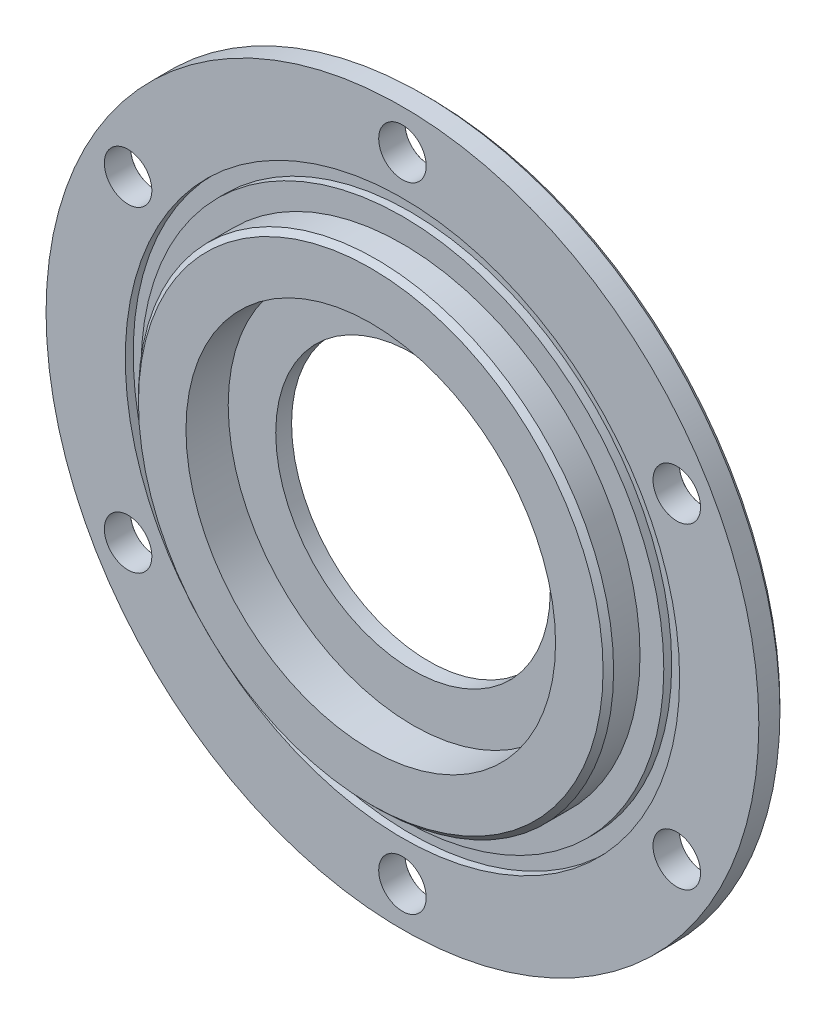
ISO-10303-21;
HEADER;
FILE_DESCRIPTION(('STEP AP214'),'2;1');
FILE_NAME('part.step','',(''),(''),'','','');
FILE_SCHEMA(('AUTOMOTIVE_DESIGN { 1 0 10303 214 1 1 1 1 }'));
ENDSEC;
DATA;
#1=APPLICATION_CONTEXT('core data for automotive mechanical design processes');
#2=APPLICATION_PROTOCOL_DEFINITION('international standard','automotive_design',2000,#1);
#3=PRODUCT_CONTEXT('',#1,'mechanical');
#4=PRODUCT('Part','Part','',(#3));
#5=PRODUCT_RELATED_PRODUCT_CATEGORY('part','',(#4));
#6=PRODUCT_DEFINITION_FORMATION('','',#4);
#7=PRODUCT_DEFINITION_CONTEXT('part definition',#1,'design');
#8=PRODUCT_DEFINITION('design','',#6,#7);
#9=PRODUCT_DEFINITION_SHAPE('','',#8);
#10=(LENGTH_UNIT() NAMED_UNIT(*) SI_UNIT(.MILLI.,.METRE.));
#11=(NAMED_UNIT(*) PLANE_ANGLE_UNIT() SI_UNIT($,.RADIAN.));
#12=(NAMED_UNIT(*) SI_UNIT($,.STERADIAN.) SOLID_ANGLE_UNIT());
#13=UNCERTAINTY_MEASURE_WITH_UNIT(LENGTH_MEASURE(1.E-05),#10,'distance_accuracy_value','');
#14=(GEOMETRIC_REPRESENTATION_CONTEXT(3) GLOBAL_UNCERTAINTY_ASSIGNED_CONTEXT((#13)) GLOBAL_UNIT_ASSIGNED_CONTEXT((#10,
#11,#12)) REPRESENTATION_CONTEXT('',''));
#15=CARTESIAN_POINT('',(0.,0.,0.));
#16=DIRECTION('',(0.,0.,1.));
#17=DIRECTION('',(1.,0.,0.));
#18=AXIS2_PLACEMENT_3D('',#15,#16,#17);
#19=CARTESIAN_POINT('',(0.,0.,5.));
#20=DIRECTION('',(0.,0.,1.));
#21=DIRECTION('',(1.,0.,0.));
#22=AXIS2_PLACEMENT_3D('',#19,#20,#21);
#23=PLANE('',#22);
#24=CARTESIAN_POINT('',(0.,0.,5.));
#25=DIRECTION('',(0.,0.,1.));
#26=DIRECTION('',(1.,0.,0.));
#27=AXIS2_PLACEMENT_3D('',#24,#25,#26);
#28=CIRCLE('',#27,45.);
#29=CARTESIAN_POINT('',(45.,0.,5.));
#30=VERTEX_POINT('',#29);
#31=EDGE_CURVE('E115',#30,#30,#28,.T.);
#32=ORIENTED_EDGE('',*,*,#31,.F.);
#33=EDGE_LOOP('',(#32));
#34=FACE_BOUND('',#33,.T.);
#35=CARTESIAN_POINT('',(0.,0.,5.));
#36=DIRECTION('',(0.,0.,1.));
#37=DIRECTION('',(1.,0.,0.));
#38=AXIS2_PLACEMENT_3D('',#35,#36,#37);
#39=CIRCLE('',#38,49.5);
#40=CARTESIAN_POINT('',(49.5,0.,5.));
#41=VERTEX_POINT('',#40);
#42=EDGE_CURVE('E163',#41,#41,#39,.T.);
#43=ORIENTED_EDGE('',*,*,#42,.T.);
#44=EDGE_LOOP('',(#43));
#45=FACE_BOUND('',#44,.T.);
#46=ADVANCED_FACE('F35',(#34,#45),#23,.T.);
#47=CARTESIAN_POINT('',(0.,0.,0.));
#48=DIRECTION('',(0.,0.,1.));
#49=DIRECTION('',(1.,0.,0.));
#50=AXIS2_PLACEMENT_3D('',#47,#48,#49);
#51=PLANE('',#50);
#52=CARTESIAN_POINT('',(-51.961524227066,30.0000000000006,0.));
#53=DIRECTION('',(0.,0.,-1.));
#54=DIRECTION('',(-1.,0.,0.));
#55=AXIS2_PLACEMENT_3D('',#52,#53,#54);
#56=CIRCLE('',#55,4.525);
#57=CARTESIAN_POINT('',(-56.486524227066,30.0000000000006,0.));
#58=VERTEX_POINT('',#57);
#59=EDGE_CURVE('E174',#58,#58,#56,.T.);
#60=ORIENTED_EDGE('',*,*,#59,.F.);
#61=EDGE_LOOP('',(#60));
#62=FACE_BOUND('',#61,.T.);
#63=CARTESIAN_POINT('',(0.,-60.,0.));
#64=DIRECTION('',(0.,0.,-1.));
#65=DIRECTION('',(-1.,0.,0.));
#66=AXIS2_PLACEMENT_3D('',#63,#64,#65);
#67=CIRCLE('',#66,4.525);
#68=CARTESIAN_POINT('',(-4.525,-60.,0.));
#69=VERTEX_POINT('',#68);
#70=EDGE_CURVE('E74',#69,#69,#67,.T.);
#71=ORIENTED_EDGE('',*,*,#70,.F.);
#72=EDGE_LOOP('',(#71));
#73=FACE_BOUND('',#72,.T.);
#74=CARTESIAN_POINT('',(51.9615242270662,-30.0000000000002,0.));
#75=DIRECTION('',(0.,0.,-1.));
#76=DIRECTION('',(-1.,0.,0.));
#77=AXIS2_PLACEMENT_3D('',#74,#75,#76);
#78=CIRCLE('',#77,4.525);
#79=CARTESIAN_POINT('',(47.4365242270662,-30.0000000000002,0.));
#80=VERTEX_POINT('',#79);
#81=EDGE_CURVE('E70',#80,#80,#78,.T.);
#82=ORIENTED_EDGE('',*,*,#81,.F.);
#83=EDGE_LOOP('',(#82));
#84=FACE_BOUND('',#83,.T.);
#85=CARTESIAN_POINT('',(51.9615242270664,29.9999999999999,0.));
#86=DIRECTION('',(0.,0.,-1.));
#87=DIRECTION('',(-1.,0.,0.));
#88=AXIS2_PLACEMENT_3D('',#85,#86,#87);
#89=CIRCLE('',#88,4.525);
#90=CARTESIAN_POINT('',(47.4365242270664,29.9999999999999,0.));
#91=VERTEX_POINT('',#90);
#92=EDGE_CURVE('E66',#91,#91,#89,.T.);
#93=ORIENTED_EDGE('',*,*,#92,.F.);
#94=EDGE_LOOP('',(#93));
#95=FACE_BOUND('',#94,.T.);
#96=CARTESIAN_POINT('',(0.,60.,0.));
#97=DIRECTION('',(0.,0.,-1.));
#98=DIRECTION('',(-1.,0.,0.));
#99=AXIS2_PLACEMENT_3D('',#96,#97,#98);
#100=CIRCLE('',#99,4.525);
#101=CARTESIAN_POINT('',(-4.525,60.,0.));
#102=VERTEX_POINT('',#101);
#103=EDGE_CURVE('E61',#102,#102,#100,.T.);
#104=ORIENTED_EDGE('',*,*,#103,.F.);
#105=EDGE_LOOP('',(#104));
#106=FACE_BOUND('',#105,.T.);
#107=CARTESIAN_POINT('',(0.,0.,0.));
#108=DIRECTION('',(0.,0.,1.));
#109=DIRECTION('',(1.,0.,0.));
#110=AXIS2_PLACEMENT_3D('',#107,#108,#109);
#111=CIRCLE('',#110,66.5);
#112=CARTESIAN_POINT('',(66.5,0.,0.));
#113=VERTEX_POINT('',#112);
#114=EDGE_CURVE('E49',#113,#113,#111,.F.);
#115=ORIENTED_EDGE('',*,*,#114,.T.);
#116=EDGE_LOOP('',(#115));
#117=FACE_BOUND('',#116,.T.);
#118=CARTESIAN_POINT('',(0.,0.,0.));
#119=DIRECTION('',(0.,0.,1.));
#120=DIRECTION('',(1.,0.,0.));
#121=AXIS2_PLACEMENT_3D('',#118,#119,#120);
#122=CIRCLE('',#121,26.);
#123=CARTESIAN_POINT('',(26.,0.,0.));
#124=VERTEX_POINT('',#123);
#125=EDGE_CURVE('E103',#124,#124,#122,.T.);
#126=ORIENTED_EDGE('',*,*,#125,.T.);
#127=EDGE_LOOP('',(#126));
#128=FACE_BOUND('',#127,.T.);
#129=CARTESIAN_POINT('',(-51.9615242270666,-29.9999999999995,0.));
#130=DIRECTION('',(0.,0.,-1.));
#131=DIRECTION('',(-1.,0.,0.));
#132=AXIS2_PLACEMENT_3D('',#129,#130,#131);
#133=CIRCLE('',#132,4.525);
#134=CARTESIAN_POINT('',(-56.4865242270666,-29.9999999999995,0.));
#135=VERTEX_POINT('',#134);
#136=EDGE_CURVE('E81',#135,#135,#133,.T.);
#137=ORIENTED_EDGE('',*,*,#136,.F.);
#138=EDGE_LOOP('',(#137));
#139=FACE_BOUND('',#138,.T.);
#140=ADVANCED_FACE('F125',(#62,#73,#84,#95,#106,#117,#128,#139),#51,.F.);
#141=CARTESIAN_POINT('',(0.,0.,5.));
#142=DIRECTION('',(0.,0.,-1.));
#143=DIRECTION('',(-1.,0.,0.));
#144=AXIS2_PLACEMENT_3D('',#141,#142,#143);
#145=CYLINDRICAL_SURFACE('',#144,67.5);
#146=CARTESIAN_POINT('',(0.,0.,1.));
#147=DIRECTION('',(0.,0.,1.));
#148=DIRECTION('',(1.,0.,0.));
#149=AXIS2_PLACEMENT_3D('',#146,#147,#148);
#150=CIRCLE('',#149,67.5);
#151=CARTESIAN_POINT('',(67.5,0.,1.));
#152=VERTEX_POINT('',#151);
#153=EDGE_CURVE('E118',#152,#152,#150,.T.);
#154=ORIENTED_EDGE('',*,*,#153,.T.);
#155=EDGE_LOOP('',(#154));
#156=FACE_BOUND('',#155,.T.);
#157=CARTESIAN_POINT('',(0.,0.,5.));
#158=DIRECTION('',(0.,0.,1.));
#159=DIRECTION('',(1.,0.,0.));
#160=AXIS2_PLACEMENT_3D('',#157,#158,#159);
#161=CIRCLE('',#160,67.5);
#162=CARTESIAN_POINT('',(67.5,0.,5.));
#163=VERTEX_POINT('',#162);
#164=EDGE_CURVE('E112',#163,#163,#161,.T.);
#165=ORIENTED_EDGE('',*,*,#164,.F.);
#166=EDGE_LOOP('',(#165));
#167=FACE_BOUND('',#166,.T.);
#168=ADVANCED_FACE('F134',(#156,#167),#145,.T.);
#169=CARTESIAN_POINT('',(0.,0.,5.));
#170=DIRECTION('',(0.,0.,1.));
#171=DIRECTION('',(1.,0.,0.));
#172=AXIS2_PLACEMENT_3D('',#169,#170,#171);
#173=CIRCLE('',#172,52.5);
#174=CARTESIAN_POINT('',(52.5,0.,5.));
#175=VERTEX_POINT('',#174);
#176=EDGE_CURVE('E168',#175,#175,#173,.T.);
#177=ORIENTED_EDGE('',*,*,#176,.F.);
#178=EDGE_LOOP('',(#177));
#179=FACE_BOUND('',#178,.T.);
#180=CARTESIAN_POINT('',(-51.961524227066,30.0000000000006,5.));
#181=DIRECTION('',(0.,0.,1.));
#182=DIRECTION('',(1.,0.,0.));
#183=AXIS2_PLACEMENT_3D('',#180,#181,#182);
#184=CIRCLE('',#183,4.5);
#185=CARTESIAN_POINT('',(-47.461524227066,30.0000000000006,5.));
#186=VERTEX_POINT('',#185);
#187=EDGE_CURVE('E40',#186,#186,#184,.T.);
#188=ORIENTED_EDGE('',*,*,#187,.F.);
#189=EDGE_LOOP('',(#188));
#190=FACE_BOUND('',#189,.T.);
#191=CARTESIAN_POINT('',(-51.9615242270666,-29.9999999999995,5.));
#192=DIRECTION('',(0.,0.,1.));
#193=DIRECTION('',(1.,0.,0.));
#194=AXIS2_PLACEMENT_3D('',#191,#192,#193);
#195=CIRCLE('',#194,4.5);
#196=CARTESIAN_POINT('',(-47.4615242270666,-29.9999999999995,5.));
#197=VERTEX_POINT('',#196);
#198=EDGE_CURVE('E72',#197,#197,#195,.T.);
#199=ORIENTED_EDGE('',*,*,#198,.F.);
#200=EDGE_LOOP('',(#199));
#201=FACE_BOUND('',#200,.T.);
#202=CARTESIAN_POINT('',(0.,-60.,5.));
#203=DIRECTION('',(0.,0.,1.));
#204=DIRECTION('',(1.,0.,0.));
#205=AXIS2_PLACEMENT_3D('',#202,#203,#204);
#206=CIRCLE('',#205,4.5);
#207=CARTESIAN_POINT('',(4.5,-60.,5.));
#208=VERTEX_POINT('',#207);
#209=EDGE_CURVE('E68',#208,#208,#206,.T.);
#210=ORIENTED_EDGE('',*,*,#209,.F.);
#211=EDGE_LOOP('',(#210));
#212=FACE_BOUND('',#211,.T.);
#213=CARTESIAN_POINT('',(51.9615242270662,-30.0000000000002,5.));
#214=DIRECTION('',(0.,0.,1.));
#215=DIRECTION('',(1.,0.,0.));
#216=AXIS2_PLACEMENT_3D('',#213,#214,#215);
#217=CIRCLE('',#216,4.5);
#218=CARTESIAN_POINT('',(56.4615242270662,-30.0000000000002,5.));
#219=VERTEX_POINT('',#218);
#220=EDGE_CURVE('E63',#219,#219,#217,.T.);
#221=ORIENTED_EDGE('',*,*,#220,.F.);
#222=EDGE_LOOP('',(#221));
#223=FACE_BOUND('',#222,.T.);
#224=CARTESIAN_POINT('',(51.9615242270664,29.9999999999999,5.));
#225=DIRECTION('',(0.,0.,1.));
#226=DIRECTION('',(1.,0.,0.));
#227=AXIS2_PLACEMENT_3D('',#224,#225,#226);
#228=CIRCLE('',#227,4.5);
#229=CARTESIAN_POINT('',(56.4615242270664,29.9999999999999,5.));
#230=VERTEX_POINT('',#229);
#231=EDGE_CURVE('E58',#230,#230,#228,.T.);
#232=ORIENTED_EDGE('',*,*,#231,.F.);
#233=EDGE_LOOP('',(#232));
#234=FACE_BOUND('',#233,.T.);
#235=CARTESIAN_POINT('',(0.,60.,5.));
#236=DIRECTION('',(0.,0.,1.));
#237=DIRECTION('',(1.,0.,0.));
#238=AXIS2_PLACEMENT_3D('',#235,#236,#237);
#239=CIRCLE('',#238,4.5);
#240=CARTESIAN_POINT('',(4.5,60.,5.));
#241=VERTEX_POINT('',#240);
#242=EDGE_CURVE('E53',#241,#241,#239,.T.);
#243=ORIENTED_EDGE('',*,*,#242,.F.);
#244=EDGE_LOOP('',(#243));
#245=FACE_BOUND('',#244,.T.);
#246=ORIENTED_EDGE('',*,*,#164,.T.);
#247=EDGE_LOOP('',(#246));
#248=FACE_BOUND('',#247,.T.);
#249=ADVANCED_FACE('F137',(#179,#190,#201,#212,#223,#234,#245,#248),#23,.T.);
#250=CARTESIAN_POINT('',(0.,0.,11.));
#251=DIRECTION('',(0.,0.,-1.));
#252=DIRECTION('',(-1.,0.,0.));
#253=AXIS2_PLACEMENT_3D('',#250,#251,#252);
#254=CYLINDRICAL_SURFACE('',#253,45.);
#255=CARTESIAN_POINT('',(0.,0.,9.99999999999995));
#256=DIRECTION('',(0.,0.,1.));
#257=DIRECTION('',(1.,0.,0.));
#258=AXIS2_PLACEMENT_3D('',#255,#256,#257);
#259=CIRCLE('',#258,45.);
#260=CARTESIAN_POINT('',(45.,0.,9.99999999999995));
#261=VERTEX_POINT('',#260);
#262=EDGE_CURVE('E10',#261,#261,#259,.F.);
#263=ORIENTED_EDGE('',*,*,#262,.T.);
#264=EDGE_LOOP('',(#263));
#265=FACE_BOUND('',#264,.T.);
#266=ORIENTED_EDGE('',*,*,#31,.T.);
#267=EDGE_LOOP('',(#266));
#268=FACE_BOUND('',#267,.T.);
#269=ADVANCED_FACE('F142',(#265,#268),#254,.T.);
#270=CARTESIAN_POINT('',(0.,0.,11.));
#271=DIRECTION('',(0.,0.,1.));
#272=DIRECTION('',(1.,0.,0.));
#273=AXIS2_PLACEMENT_3D('',#270,#271,#272);
#274=PLANE('',#273);
#275=CARTESIAN_POINT('',(0.,0.,11.));
#276=DIRECTION('',(0.,0.,1.));
#277=DIRECTION('',(1.,0.,0.));
#278=AXIS2_PLACEMENT_3D('',#275,#276,#277);
#279=CIRCLE('',#278,44.);
#280=CARTESIAN_POINT('',(44.,0.,11.));
#281=VERTEX_POINT('',#280);
#282=EDGE_CURVE('E44',#281,#281,#279,.T.);
#283=ORIENTED_EDGE('',*,*,#282,.T.);
#284=EDGE_LOOP('',(#283));
#285=FACE_BOUND('',#284,.T.);
#286=CARTESIAN_POINT('',(0.,0.,11.));
#287=DIRECTION('',(0.,0.,1.));
#288=DIRECTION('',(1.,0.,0.));
#289=AXIS2_PLACEMENT_3D('',#286,#287,#288);
#290=CIRCLE('',#289,35.);
#291=CARTESIAN_POINT('',(35.,0.,11.));
#292=VERTEX_POINT('',#291);
#293=EDGE_CURVE('E106',#292,#292,#290,.T.);
#294=ORIENTED_EDGE('',*,*,#293,.F.);
#295=EDGE_LOOP('',(#294));
#296=FACE_BOUND('',#295,.T.);
#297=ADVANCED_FACE('F148',(#285,#296),#274,.T.);
#298=CARTESIAN_POINT('',(0.,0.,3.));
#299=DIRECTION('',(0.,0.,1.));
#300=DIRECTION('',(1.,0.,0.));
#301=AXIS2_PLACEMENT_3D('',#298,#299,#300);
#302=CYLINDRICAL_SURFACE('',#301,35.);
#303=CARTESIAN_POINT('',(0.,0.,3.));
#304=DIRECTION('',(0.,0.,1.));
#305=DIRECTION('',(1.,0.,0.));
#306=AXIS2_PLACEMENT_3D('',#303,#304,#305);
#307=CIRCLE('',#306,35.);
#308=CARTESIAN_POINT('',(35.,0.,3.));
#309=VERTEX_POINT('',#308);
#310=EDGE_CURVE('E109',#309,#309,#307,.T.);
#311=ORIENTED_EDGE('',*,*,#310,.F.);
#312=EDGE_LOOP('',(#311));
#313=FACE_BOUND('',#312,.T.);
#314=ORIENTED_EDGE('',*,*,#293,.T.);
#315=EDGE_LOOP('',(#314));
#316=FACE_BOUND('',#315,.T.);
#317=ADVANCED_FACE('F223',(#313,#316),#302,.F.);
#318=CARTESIAN_POINT('',(0.,0.,3.));
#319=DIRECTION('',(0.,0.,1.));
#320=DIRECTION('',(1.,0.,0.));
#321=AXIS2_PLACEMENT_3D('',#318,#319,#320);
#322=PLANE('',#321);
#323=CARTESIAN_POINT('',(0.,0.,3.));
#324=DIRECTION('',(0.,0.,1.));
#325=DIRECTION('',(1.,0.,0.));
#326=AXIS2_PLACEMENT_3D('',#323,#324,#325);
#327=CIRCLE('',#326,26.);
#328=CARTESIAN_POINT('',(26.,0.,3.));
#329=VERTEX_POINT('',#328);
#330=EDGE_CURVE('E56',#329,#329,#327,.T.);
#331=ORIENTED_EDGE('',*,*,#330,.F.);
#332=EDGE_LOOP('',(#331));
#333=FACE_BOUND('',#332,.T.);
#334=ORIENTED_EDGE('',*,*,#310,.T.);
#335=EDGE_LOOP('',(#334));
#336=FACE_BOUND('',#335,.T.);
#337=ADVANCED_FACE('F219',(#333,#336),#322,.T.);
#338=CARTESIAN_POINT('',(0.,0.,0.));
#339=DIRECTION('',(0.,0.,1.));
#340=DIRECTION('',(1.,0.,0.));
#341=AXIS2_PLACEMENT_3D('',#338,#339,#340);
#342=CYLINDRICAL_SURFACE('',#341,26.);
#343=ORIENTED_EDGE('',*,*,#125,.F.);
#344=EDGE_LOOP('',(#343));
#345=FACE_BOUND('',#344,.T.);
#346=ORIENTED_EDGE('',*,*,#330,.T.);
#347=EDGE_LOOP('',(#346));
#348=FACE_BOUND('',#347,.T.);
#349=ADVANCED_FACE('F131',(#345,#348),#342,.F.);
#350=CARTESIAN_POINT('',(0.,0.,1.));
#351=DIRECTION('',(0.,0.,1.));
#352=DIRECTION('',(1.,0.,0.));
#353=AXIS2_PLACEMENT_3D('',#350,#351,#352);
#354=CONICAL_SURFACE('',#353,67.5,0.785398163397448);
#355=ORIENTED_EDGE('',*,*,#114,.F.);
#356=EDGE_LOOP('',(#355));
#357=FACE_BOUND('',#356,.T.);
#358=ORIENTED_EDGE('',*,*,#153,.F.);
#359=EDGE_LOOP('',(#358));
#360=FACE_BOUND('',#359,.T.);
#361=ADVANCED_FACE('F128',(#357,#360),#354,.T.);
#362=CARTESIAN_POINT('',(0.,0.,11.));
#363=DIRECTION('',(0.,0.,-1.));
#364=DIRECTION('',(-1.,0.,0.));
#365=AXIS2_PLACEMENT_3D('',#362,#363,#364);
#366=CONICAL_SURFACE('',#365,44.,0.785398163397448);
#367=ORIENTED_EDGE('',*,*,#262,.F.);
#368=EDGE_LOOP('',(#367));
#369=FACE_BOUND('',#368,.T.);
#370=ORIENTED_EDGE('',*,*,#282,.F.);
#371=EDGE_LOOP('',(#370));
#372=FACE_BOUND('',#371,.T.);
#373=ADVANCED_FACE('F38',(#369,#372),#366,.T.);
#374=CARTESIAN_POINT('',(0.,60.,0.));
#375=DIRECTION('',(0.,0.,-1.));
#376=DIRECTION('',(-1.,0.,0.));
#377=AXIS2_PLACEMENT_3D('',#374,#375,#376);
#378=CYLINDRICAL_SURFACE('',#377,4.5);
#379=ORIENTED_EDGE('',*,*,#242,.T.);
#380=EDGE_LOOP('',(#379));
#381=FACE_BOUND('',#380,.T.);
#382=CARTESIAN_POINT('',(0.,60.,0.0249999999999972));
#383=DIRECTION('',(0.,0.,-1.));
#384=DIRECTION('',(-1.,0.,0.));
#385=AXIS2_PLACEMENT_3D('',#382,#383,#384);
#386=CIRCLE('',#385,4.5);
#387=CARTESIAN_POINT('',(-4.5,60.,0.0249999999999972));
#388=VERTEX_POINT('',#387);
#389=EDGE_CURVE('E57',#388,#388,#386,.T.);
#390=ORIENTED_EDGE('',*,*,#389,.T.);
#391=EDGE_LOOP('',(#390));
#392=FACE_BOUND('',#391,.T.);
#393=ADVANCED_FACE('F196',(#381,#392),#378,.F.);
#394=CARTESIAN_POINT('',(0.,60.,0.));
#395=DIRECTION('',(0.,0.,-1.));
#396=DIRECTION('',(-1.,0.,0.));
#397=AXIS2_PLACEMENT_3D('',#394,#395,#396);
#398=CONICAL_SURFACE('',#397,4.525,0.785398163397535);
#399=ORIENTED_EDGE('',*,*,#389,.F.);
#400=EDGE_LOOP('',(#399));
#401=FACE_BOUND('',#400,.T.);
#402=ORIENTED_EDGE('',*,*,#103,.T.);
#403=EDGE_LOOP('',(#402));
#404=FACE_BOUND('',#403,.T.);
#405=ADVANCED_FACE('F199',(#401,#404),#398,.F.);
#406=CARTESIAN_POINT('',(51.9615242270664,29.9999999999999,0.));
#407=DIRECTION('',(0.,0.,-1.));
#408=DIRECTION('',(-1.,0.,0.));
#409=AXIS2_PLACEMENT_3D('',#406,#407,#408);
#410=CYLINDRICAL_SURFACE('',#409,4.5);
#411=ORIENTED_EDGE('',*,*,#231,.T.);
#412=EDGE_LOOP('',(#411));
#413=FACE_BOUND('',#412,.T.);
#414=CARTESIAN_POINT('',(51.9615242270664,29.9999999999999,0.0249999999999972));
#415=DIRECTION('',(0.,0.,-1.));
#416=DIRECTION('',(-1.,0.,0.));
#417=AXIS2_PLACEMENT_3D('',#414,#415,#416);
#418=CIRCLE('',#417,4.5);
#419=CARTESIAN_POINT('',(47.4615242270664,29.9999999999999,0.0249999999999972));
#420=VERTEX_POINT('',#419);
#421=EDGE_CURVE('E62',#420,#420,#418,.T.);
#422=ORIENTED_EDGE('',*,*,#421,.T.);
#423=EDGE_LOOP('',(#422));
#424=FACE_BOUND('',#423,.T.);
#425=ADVANCED_FACE('F205',(#413,#424),#410,.F.);
#426=CARTESIAN_POINT('',(51.9615242270664,29.9999999999999,0.));
#427=DIRECTION('',(0.,0.,-1.));
#428=DIRECTION('',(-1.,0.,0.));
#429=AXIS2_PLACEMENT_3D('',#426,#427,#428);
#430=CONICAL_SURFACE('',#429,4.525,0.785398163397552);
#431=ORIENTED_EDGE('',*,*,#421,.F.);
#432=EDGE_LOOP('',(#431));
#433=FACE_BOUND('',#432,.T.);
#434=ORIENTED_EDGE('',*,*,#92,.T.);
#435=EDGE_LOOP('',(#434));
#436=FACE_BOUND('',#435,.T.);
#437=ADVANCED_FACE('F212',(#433,#436),#430,.F.);
#438=CARTESIAN_POINT('',(51.9615242270662,-30.0000000000002,0.));
#439=DIRECTION('',(0.,0.,-1.));
#440=DIRECTION('',(-1.,0.,0.));
#441=AXIS2_PLACEMENT_3D('',#438,#439,#440);
#442=CYLINDRICAL_SURFACE('',#441,4.5);
#443=ORIENTED_EDGE('',*,*,#220,.T.);
#444=EDGE_LOOP('',(#443));
#445=FACE_BOUND('',#444,.T.);
#446=CARTESIAN_POINT('',(51.9615242270662,-30.0000000000002,0.0249999999999972));
#447=DIRECTION('',(0.,0.,-1.));
#448=DIRECTION('',(-1.,0.,0.));
#449=AXIS2_PLACEMENT_3D('',#446,#447,#448);
#450=CIRCLE('',#449,4.5);
#451=CARTESIAN_POINT('',(47.4615242270662,-30.0000000000002,0.0249999999999972));
#452=VERTEX_POINT('',#451);
#453=EDGE_CURVE('E67',#452,#452,#450,.T.);
#454=ORIENTED_EDGE('',*,*,#453,.T.);
#455=EDGE_LOOP('',(#454));
#456=FACE_BOUND('',#455,.T.);
#457=ADVANCED_FACE('F272',(#445,#456),#442,.F.);
#458=CARTESIAN_POINT('',(51.9615242270662,-30.0000000000002,0.));
#459=DIRECTION('',(0.,0.,-1.));
#460=DIRECTION('',(-1.,0.,0.));
#461=AXIS2_PLACEMENT_3D('',#458,#459,#460);
#462=CONICAL_SURFACE('',#461,4.525,0.785398163397552);
#463=ORIENTED_EDGE('',*,*,#453,.F.);
#464=EDGE_LOOP('',(#463));
#465=FACE_BOUND('',#464,.T.);
#466=ORIENTED_EDGE('',*,*,#81,.T.);
#467=EDGE_LOOP('',(#466));
#468=FACE_BOUND('',#467,.T.);
#469=ADVANCED_FACE('F281',(#465,#468),#462,.F.);
#470=CARTESIAN_POINT('',(0.,-60.,0.));
#471=DIRECTION('',(0.,0.,-1.));
#472=DIRECTION('',(-1.,0.,0.));
#473=AXIS2_PLACEMENT_3D('',#470,#471,#472);
#474=CYLINDRICAL_SURFACE('',#473,4.5);
#475=ORIENTED_EDGE('',*,*,#209,.T.);
#476=EDGE_LOOP('',(#475));
#477=FACE_BOUND('',#476,.T.);
#478=CARTESIAN_POINT('',(0.,-60.,0.0249999999999972));
#479=DIRECTION('',(0.,0.,-1.));
#480=DIRECTION('',(-1.,0.,0.));
#481=AXIS2_PLACEMENT_3D('',#478,#479,#480);
#482=CIRCLE('',#481,4.5);
#483=CARTESIAN_POINT('',(-4.5,-60.,0.0249999999999972));
#484=VERTEX_POINT('',#483);
#485=EDGE_CURVE('E71',#484,#484,#482,.T.);
#486=ORIENTED_EDGE('',*,*,#485,.T.);
#487=EDGE_LOOP('',(#486));
#488=FACE_BOUND('',#487,.T.);
#489=ADVANCED_FACE('F291',(#477,#488),#474,.F.);
#490=CARTESIAN_POINT('',(0.,-60.,0.));
#491=DIRECTION('',(0.,0.,-1.));
#492=DIRECTION('',(-1.,0.,0.));
#493=AXIS2_PLACEMENT_3D('',#490,#491,#492);
#494=CONICAL_SURFACE('',#493,4.525,0.785398163397535);
#495=ORIENTED_EDGE('',*,*,#485,.F.);
#496=EDGE_LOOP('',(#495));
#497=FACE_BOUND('',#496,.T.);
#498=ORIENTED_EDGE('',*,*,#70,.T.);
#499=EDGE_LOOP('',(#498));
#500=FACE_BOUND('',#499,.T.);
#501=ADVANCED_FACE('F301',(#497,#500),#494,.F.);
#502=CARTESIAN_POINT('',(-51.9615242270666,-29.9999999999995,0.));
#503=DIRECTION('',(0.,0.,-1.));
#504=DIRECTION('',(-1.,0.,0.));
#505=AXIS2_PLACEMENT_3D('',#502,#503,#504);
#506=CYLINDRICAL_SURFACE('',#505,4.5);
#507=ORIENTED_EDGE('',*,*,#198,.T.);
#508=EDGE_LOOP('',(#507));
#509=FACE_BOUND('',#508,.T.);
#510=CARTESIAN_POINT('',(-51.9615242270666,-29.9999999999995,0.0249999999999972));
#511=DIRECTION('',(0.,0.,-1.));
#512=DIRECTION('',(-1.,0.,0.));
#513=AXIS2_PLACEMENT_3D('',#510,#511,#512);
#514=CIRCLE('',#513,4.5);
#515=CARTESIAN_POINT('',(-56.4615242270666,-29.9999999999995,0.0249999999999972));
#516=VERTEX_POINT('',#515);
#517=EDGE_CURVE('E75',#516,#516,#514,.T.);
#518=ORIENTED_EDGE('',*,*,#517,.T.);
#519=EDGE_LOOP('',(#518));
#520=FACE_BOUND('',#519,.T.);
#521=ADVANCED_FACE('F311',(#509,#520),#506,.F.);
#522=CARTESIAN_POINT('',(-51.9615242270666,-29.9999999999995,0.));
#523=DIRECTION('',(0.,0.,-1.));
#524=DIRECTION('',(-1.,0.,0.));
#525=AXIS2_PLACEMENT_3D('',#522,#523,#524);
#526=CONICAL_SURFACE('',#525,4.525,0.785398163397552);
#527=ORIENTED_EDGE('',*,*,#517,.F.);
#528=EDGE_LOOP('',(#527));
#529=FACE_BOUND('',#528,.T.);
#530=ORIENTED_EDGE('',*,*,#136,.T.);
#531=EDGE_LOOP('',(#530));
#532=FACE_BOUND('',#531,.T.);
#533=ADVANCED_FACE('F321',(#529,#532),#526,.F.);
#534=CARTESIAN_POINT('',(-51.961524227066,30.0000000000006,0.));
#535=DIRECTION('',(0.,0.,-1.));
#536=DIRECTION('',(-1.,0.,0.));
#537=AXIS2_PLACEMENT_3D('',#534,#535,#536);
#538=CYLINDRICAL_SURFACE('',#537,4.5);
#539=ORIENTED_EDGE('',*,*,#187,.T.);
#540=EDGE_LOOP('',(#539));
#541=FACE_BOUND('',#540,.T.);
#542=CARTESIAN_POINT('',(-51.961524227066,30.0000000000006,0.0249999999999972));
#543=DIRECTION('',(0.,0.,-1.));
#544=DIRECTION('',(-1.,0.,0.));
#545=AXIS2_PLACEMENT_3D('',#542,#543,#544);
#546=CIRCLE('',#545,4.5);
#547=CARTESIAN_POINT('',(-56.461524227066,30.0000000000006,0.0249999999999972));
#548=VERTEX_POINT('',#547);
#549=EDGE_CURVE('E178',#548,#548,#546,.T.);
#550=ORIENTED_EDGE('',*,*,#549,.T.);
#551=EDGE_LOOP('',(#550));
#552=FACE_BOUND('',#551,.T.);
#553=ADVANCED_FACE('F185',(#541,#552),#538,.F.);
#554=CARTESIAN_POINT('',(-51.961524227066,30.0000000000006,0.));
#555=DIRECTION('',(0.,0.,-1.));
#556=DIRECTION('',(-1.,0.,0.));
#557=AXIS2_PLACEMENT_3D('',#554,#555,#556);
#558=CONICAL_SURFACE('',#557,4.525,0.785398163397552);
#559=ORIENTED_EDGE('',*,*,#549,.F.);
#560=EDGE_LOOP('',(#559));
#561=FACE_BOUND('',#560,.T.);
#562=ORIENTED_EDGE('',*,*,#59,.T.);
#563=EDGE_LOOP('',(#562));
#564=FACE_BOUND('',#563,.T.);
#565=ADVANCED_FACE('F339',(#561,#564),#558,.F.);
#566=CARTESIAN_POINT('',(0.,0.,3.5));
#567=DIRECTION('',(0.,0.,1.));
#568=DIRECTION('',(1.,0.,0.));
#569=AXIS2_PLACEMENT_3D('',#566,#567,#568);
#570=CYLINDRICAL_SURFACE('',#569,52.5);
#571=CARTESIAN_POINT('',(0.,0.,3.5));
#572=DIRECTION('',(0.,0.,1.));
#573=DIRECTION('',(1.,0.,0.));
#574=AXIS2_PLACEMENT_3D('',#571,#572,#573);
#575=CIRCLE('',#574,52.5);
#576=CARTESIAN_POINT('',(52.5,0.,3.5));
#577=VERTEX_POINT('',#576);
#578=EDGE_CURVE('E171',#577,#577,#575,.T.);
#579=ORIENTED_EDGE('',*,*,#578,.F.);
#580=EDGE_LOOP('',(#579));
#581=FACE_BOUND('',#580,.T.);
#582=ORIENTED_EDGE('',*,*,#176,.T.);
#583=EDGE_LOOP('',(#582));
#584=FACE_BOUND('',#583,.T.);
#585=ADVANCED_FACE('F347',(#581,#584),#570,.F.);
#586=CARTESIAN_POINT('',(0.,0.,3.5));
#587=DIRECTION('',(0.,0.,1.));
#588=DIRECTION('',(1.,0.,0.));
#589=AXIS2_PLACEMENT_3D('',#586,#587,#588);
#590=PLANE('',#589);
#591=CARTESIAN_POINT('',(0.,0.,3.5));
#592=DIRECTION('',(0.,0.,1.));
#593=DIRECTION('',(1.,0.,0.));
#594=AXIS2_PLACEMENT_3D('',#591,#592,#593);
#595=CIRCLE('',#594,49.5);
#596=CARTESIAN_POINT('',(49.5,0.,3.5));
#597=VERTEX_POINT('',#596);
#598=EDGE_CURVE('E165',#597,#597,#595,.T.);
#599=ORIENTED_EDGE('',*,*,#598,.F.);
#600=EDGE_LOOP('',(#599));
#601=FACE_BOUND('',#600,.T.);
#602=ORIENTED_EDGE('',*,*,#578,.T.);
#603=EDGE_LOOP('',(#602));
#604=FACE_BOUND('',#603,.T.);
#605=ADVANCED_FACE('F368',(#601,#604),#590,.T.);
#606=CARTESIAN_POINT('',(0.,0.,3.5));
#607=DIRECTION('',(0.,0.,1.));
#608=DIRECTION('',(1.,0.,0.));
#609=AXIS2_PLACEMENT_3D('',#606,#607,#608);
#610=CYLINDRICAL_SURFACE('',#609,49.5);
#611=ORIENTED_EDGE('',*,*,#598,.T.);
#612=EDGE_LOOP('',(#611));
#613=FACE_BOUND('',#612,.T.);
#614=ORIENTED_EDGE('',*,*,#42,.F.);
#615=EDGE_LOOP('',(#614));
#616=FACE_BOUND('',#615,.T.);
#617=ADVANCED_FACE('F378',(#613,#616),#610,.T.);
#618=CLOSED_SHELL('',(#46,#140,#168,#249,#269,#297,#317,#337,#349,#361,#373,#393,#405,#425,#437,
#457,#469,#489,#501,#521,#533,#553,#565,#585,#605,#617));
#619=MANIFOLD_SOLID_BREP('B2',#618);
#620=ADVANCED_BREP_SHAPE_REPRESENTATION('',(#18,#619),#14);
#621=SHAPE_DEFINITION_REPRESENTATION(#9,#620);
ENDSEC;
END-ISO-10303-21;
